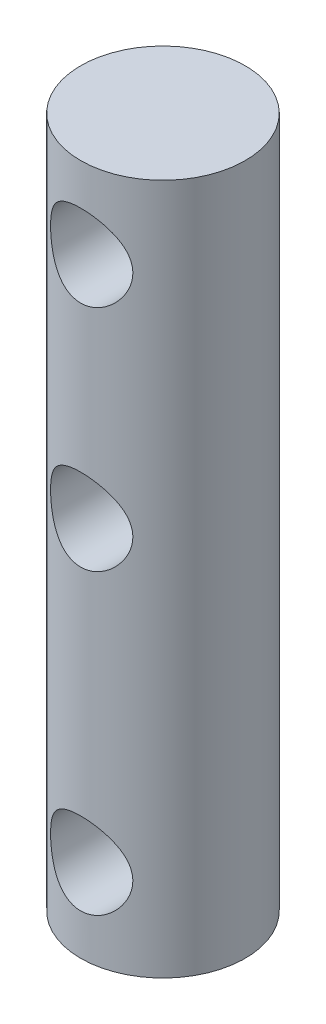
ISO-10303-21;
HEADER;
FILE_DESCRIPTION(('STEP AP214'),'2;1');
FILE_NAME('part.step','',(''),(''),'','','');
FILE_SCHEMA(('AUTOMOTIVE_DESIGN { 1 0 10303 214 1 1 1 1 }'));
ENDSEC;
DATA;
#1=APPLICATION_CONTEXT('core data for automotive mechanical design processes');
#2=APPLICATION_PROTOCOL_DEFINITION('international standard','automotive_design',2000,#1);
#3=PRODUCT_CONTEXT('',#1,'mechanical');
#4=PRODUCT('Part','Part','',(#3));
#5=PRODUCT_RELATED_PRODUCT_CATEGORY('part','',(#4));
#6=PRODUCT_DEFINITION_FORMATION('','',#4);
#7=PRODUCT_DEFINITION_CONTEXT('part definition',#1,'design');
#8=PRODUCT_DEFINITION('design','',#6,#7);
#9=PRODUCT_DEFINITION_SHAPE('','',#8);
#10=(LENGTH_UNIT() NAMED_UNIT(*) SI_UNIT(.MILLI.,.METRE.));
#11=(NAMED_UNIT(*) PLANE_ANGLE_UNIT() SI_UNIT($,.RADIAN.));
#12=(NAMED_UNIT(*) SI_UNIT($,.STERADIAN.) SOLID_ANGLE_UNIT());
#13=UNCERTAINTY_MEASURE_WITH_UNIT(LENGTH_MEASURE(1.E-05),#10,'distance_accuracy_value','');
#14=(GEOMETRIC_REPRESENTATION_CONTEXT(3) GLOBAL_UNCERTAINTY_ASSIGNED_CONTEXT((#13)) GLOBAL_UNIT_ASSIGNED_CONTEXT((#10,
#11,#12)) REPRESENTATION_CONTEXT('',''));
#15=CARTESIAN_POINT('',(0.,0.,0.));
#16=DIRECTION('',(0.,0.,1.));
#17=DIRECTION('',(1.,0.,0.));
#18=AXIS2_PLACEMENT_3D('',#15,#16,#17);
#19=CARTESIAN_POINT('',(0.,21.,0.));
#20=DIRECTION('',(0.,-1.,0.));
#21=DIRECTION('',(0.,0.,-1.));
#22=AXIS2_PLACEMENT_3D('',#19,#20,#21);
#23=CYLINDRICAL_SURFACE('',#22,2.5);
#24=CARTESIAN_POINT('',(0.,19.75,-2.5));
#25=CARTESIAN_POINT('',(-0.0657149536912332,19.7499958721006,-2.49999641755189));
#26=CARTESIAN_POINT('',(-0.131508249622541,19.7447874085979,-2.49738113774397));
#27=CARTESIAN_POINT('',(-0.261150294085531,19.7241838995739,-2.48717695046745));
#28=CARTESIAN_POINT('',(-0.32499510839188,19.7087695087529,-2.47957859786229));
#29=CARTESIAN_POINT('',(-0.448666931100719,19.668507739229,-2.46020349254139));
#30=CARTESIAN_POINT('',(-0.508508503673976,19.64369701969,-2.448442989719));
#31=CARTESIAN_POINT('',(-0.623090771008207,19.5855367232938,-2.42182220644723));
#32=CARTESIAN_POINT('',(-0.677831867487563,19.5521878196889,-2.40696217041912));
#33=CARTESIAN_POINT('',(-0.7843847722024,19.4756034381434,-2.37445322822571));
#34=CARTESIAN_POINT('',(-0.835819013902642,19.4318919009505,-2.3566899890942));
#35=CARTESIAN_POINT('',(-0.930974306083724,19.3368481509412,-2.3207496280843));
#36=CARTESIAN_POINT('',(-0.974689478883459,19.2855101852845,-2.30257220261294));
#37=CARTESIAN_POINT('',(-1.05656500056285,19.1718958130958,-2.26623688996684));
#38=CARTESIAN_POINT('',(-1.09403166943955,19.1090798770676,-2.24818983712665));
#39=CARTESIAN_POINT('',(-1.15771028361337,18.9770408300172,-2.21607473465401));
#40=CARTESIAN_POINT('',(-1.18393026870792,18.9078223390966,-2.20200384508737));
#41=CARTESIAN_POINT('',(-1.22266555273574,18.7691686182226,-2.18072333797261));
#42=CARTESIAN_POINT('',(-1.23590732135055,18.6999944349158,-2.17315339479642));
#43=CARTESIAN_POINT('',(-1.25053374163606,18.5600264527757,-2.1647736243566));
#44=CARTESIAN_POINT('',(-1.25193011046634,18.4892343239111,-2.1639571167911));
#45=CARTESIAN_POINT('',(-1.24335910896537,18.3571424696058,-2.1688866282156));
#46=CARTESIAN_POINT('',(-1.23473069942103,18.2957199609712,-2.17385954577517));
#47=CARTESIAN_POINT('',(-1.20867481132117,18.1753476132837,-2.18845285917313));
#48=CARTESIAN_POINT('',(-1.19124452987206,18.1163985683684,-2.1980747353972));
#49=CARTESIAN_POINT('',(-1.1477622254825,18.0009635842929,-2.22109345515926));
#50=CARTESIAN_POINT('',(-1.12151883389499,17.9445670015178,-2.23457300829998));
#51=CARTESIAN_POINT('',(-1.061302109585,17.8367071342625,-2.26379255351755));
#52=CARTESIAN_POINT('',(-1.02732530476558,17.7852460804999,-2.27953355975238));
#53=CARTESIAN_POINT('',(-0.947582568640986,17.681848434071,-2.31391447379107));
#54=CARTESIAN_POINT('',(-0.900868072961603,17.6306789080298,-2.33266887795933));
#55=CARTESIAN_POINT('',(-0.799444473426718,17.5365807267614,-2.36934529125509));
#56=CARTESIAN_POINT('',(-0.744731570717857,17.4936560099577,-2.38726689948501));
#57=CARTESIAN_POINT('',(-0.62564563228981,17.4153929237128,-2.42127484103705));
#58=CARTESIAN_POINT('',(-0.56094198949926,17.3804994094428,-2.43723730202509));
#59=CARTESIAN_POINT('',(-0.425582769360995,17.3223787136962,-2.46447351401553));
#60=CARTESIAN_POINT('',(-0.354931970331595,17.299142268731,-2.47575098679441));
#61=CARTESIAN_POINT('',(-0.215958114575878,17.2669057453542,-2.49155417176795));
#62=CARTESIAN_POINT('',(-0.147926913185406,17.2568859553165,-2.4965617287664));
#63=CARTESIAN_POINT('',(-0.0109744999366928,17.2481690860819,-2.50091266823877));
#64=CARTESIAN_POINT('',(0.057946274837376,17.2494666429507,-2.5002587340164));
#65=CARTESIAN_POINT('',(0.189041214982491,17.2627583605234,-2.49363990316801));
#66=CARTESIAN_POINT('',(0.251324260062443,17.2739156659125,-2.48809057110237));
#67=CARTESIAN_POINT('',(0.373008615377396,17.3052975898689,-2.47277714143524));
#68=CARTESIAN_POINT('',(0.432409607113746,17.3255232080667,-2.46301257917916));
#69=CARTESIAN_POINT('',(0.548610760562081,17.3749980830415,-2.43980314267087));
#70=CARTESIAN_POINT('',(0.605287996257691,17.404488812646,-2.42626102212424));
#71=CARTESIAN_POINT('',(0.713076702123651,17.4713844195576,-2.39679967896386));
#72=CARTESIAN_POINT('',(0.764185787219103,17.5087926682418,-2.38087944457231));
#73=CARTESIAN_POINT('',(0.864709611613317,17.5947005316661,-2.3463527667183));
#74=CARTESIAN_POINT('',(0.913465097280799,17.643928585567,-2.32763606060552));
#75=CARTESIAN_POINT('',(1.00232040139155,17.7499064390866,-2.29077989504843));
#76=CARTESIAN_POINT('',(1.04241423211355,17.8066613985205,-2.27264084226908));
#77=CARTESIAN_POINT('',(1.11463489312212,17.9295545677504,-2.23813990282585));
#78=CARTESIAN_POINT('',(1.1462818698483,17.9960140827607,-2.2219066207934));
#79=CARTESIAN_POINT('',(1.19760353251725,18.1343875846157,-2.19467590460158));
#80=CARTESIAN_POINT('',(1.21729364485946,18.2062944081265,-2.18367172800772));
#81=CARTESIAN_POINT('',(1.2423271093121,18.3461377785768,-2.16951876260833));
#82=CARTESIAN_POINT('',(1.24886624550108,18.4137928167863,-2.16571729325614));
#83=CARTESIAN_POINT('',(1.25086144297599,18.5493088339634,-2.16456693307719));
#84=CARTESIAN_POINT('',(1.2463223082805,18.6171697109243,-2.16721524534441));
#85=CARTESIAN_POINT('',(1.22740765699033,18.744354376915,-2.17797327562531));
#86=CARTESIAN_POINT('',(1.2140103929285,18.8038755876805,-2.18553868102992));
#87=CARTESIAN_POINT('',(1.17896919778081,18.9197601492809,-2.20463770234897));
#88=CARTESIAN_POINT('',(1.15732261394976,18.976122477615,-2.21617259462094));
#89=CARTESIAN_POINT('',(1.10476968162585,19.0882810637333,-2.2428566295566));
#90=CARTESIAN_POINT('',(1.07333892227057,19.1437848772871,-2.25819652995238));
#91=CARTESIAN_POINT('',(1.0026887145458,19.2490931702257,-2.29044164543238));
#92=CARTESIAN_POINT('',(0.963465214048313,19.2988946631481,-2.30734767243152));
#93=CARTESIAN_POINT('',(0.872754158330804,19.397677477947,-2.34327903949141));
#94=CARTESIAN_POINT('',(0.820355528762717,19.4458238779524,-2.36231229139336));
#95=CARTESIAN_POINT('',(0.707693507775352,19.5328287292795,-2.39847190318859));
#96=CARTESIAN_POINT('',(0.647425904070984,19.5716821742829,-2.4155972326005));
#97=CARTESIAN_POINT('',(0.519914496024935,19.6390454534528,-2.44622511981379));
#98=CARTESIAN_POINT('',(0.452624379918269,19.6674802117643,-2.45970120703636));
#99=CARTESIAN_POINT('',(0.31342762661774,19.7122602098987,-2.48126676704332));
#100=CARTESIAN_POINT('',(0.241534749528959,19.728639808537,-2.48937154216165));
#101=CARTESIAN_POINT('',(0.140752433104231,19.7423717638448,-2.49619327387079));
#102=CARTESIAN_POINT('',(0.112702349299375,19.7452283010795,-2.49761706674002));
#103=CARTESIAN_POINT('',(0.0564396647589483,19.749043331896,-2.49952121222331));
#104=CARTESIAN_POINT('',(0.0282270595592273,19.750001773089,-2.50000153879704));
#105=CARTESIAN_POINT('',(0.,19.75,-2.5));
#106=B_SPLINE_CURVE_WITH_KNOTS('',3,(#24,#25,#26,#27,#28,#29,#30,#31,#32,#33,#34,#35,#36,#37,
#38,#39,#40,#41,#42,#43,#44,#45,#46,#47,#48,#49,#50,#51,#52,#53,#54,#55,#56,#57,#58,#59,#60,#61,
#62,#63,#64,#65,#66,#67,#68,#69,#70,#71,#72,#73,#74,#75,#76,#77,#78,#79,#80,#81,#82,#83,#84,#85,
#86,#87,#88,#89,#90,#91,#92,#93,#94,#95,#96,#97,#98,#99,#100,#101,#102,#103,#104,#105),
.UNSPECIFIED.,.T.,.F.,(4,2,2,2,2,2,2,2,2,2,2,2,2,2,2,2,2,2,2,2,2,2,2,2,2,2,2,2,2,2,2,2,2,2,2,2,
2,2,2,2,4),(0.,0.197030321775366,0.394435187136497,0.591077694365374,0.78770470072696,
0.996227198397616,1.20490779706754,1.42977158038441,1.65447434872851,1.86572515175287,
2.07676696661276,2.26257140511651,2.44843504907099,2.63862800210609,2.82890651575278,
3.04331176667348,3.25781918248358,3.48228777768051,3.7065777114035,3.91229113089182,
4.11790705639345,4.30758633132653,4.49728652038665,4.69241070034873,4.88761813435424,
5.10199513305524,5.3165198576929,5.54143352699593,5.76605639925972,5.96911634372967,
6.17208824825007,6.35572412805229,6.53941910979598,6.73545570969518,6.93159451423697,
7.15156553440623,7.37165479220716,7.59330017078657,7.81431135781163,7.89894100172122,
7.98357298143559),.UNSPECIFIED.);
#107=CARTESIAN_POINT('',(0.,19.75,-2.5));
#108=VERTEX_POINT('',#107);
#109=EDGE_CURVE('E10',#108,#108,#106,.T.);
#110=ORIENTED_EDGE('',*,*,#109,.T.);
#111=EDGE_LOOP('',(#110));
#112=FACE_BOUND('',#111,.T.);
#113=CARTESIAN_POINT('',(1.25,18.5,2.1650635094611));
#114=CARTESIAN_POINT('',(1.24999545384317,18.4348652397559,2.16506918410574));
#115=CARTESIAN_POINT('',(1.24487496341652,18.3696482355937,2.16804751484696));
#116=CARTESIAN_POINT('',(1.22465401237257,18.2412159191536,2.17952958065065));
#117=CARTESIAN_POINT('',(1.20953258069272,18.1780051061957,2.18804492569449));
#118=CARTESIAN_POINT('',(1.17012493587477,18.0556854195701,2.20936683256748));
#119=CARTESIAN_POINT('',(1.14588744061716,17.996556684408,2.22215054341565));
#120=CARTESIAN_POINT('',(1.08908440672047,17.8832197475041,2.25053331021072));
#121=CARTESIAN_POINT('',(1.05651841754472,17.8290118121719,2.26613251845081));
#122=CARTESIAN_POINT('',(0.980833175663598,17.7221178393031,2.29996086321802));
#123=CARTESIAN_POINT('',(0.937065045179712,17.6699260804081,2.31830079547442));
#124=CARTESIAN_POINT('',(0.841567259518083,17.5732395144916,2.35464978482132));
#125=CARTESIAN_POINT('',(0.789833657227863,17.5287485467706,2.37265867289062));
#126=CARTESIAN_POINT('',(0.67561195426818,17.4457910610654,2.40776846191186));
#127=CARTESIAN_POINT('',(0.612633986265717,17.4079327901756,2.42472633022716));
#128=CARTESIAN_POINT('',(0.480196283249379,17.3435739334428,2.45438445124411));
#129=CARTESIAN_POINT('',(0.410740672672693,17.3170661798285,2.46708738979677));
#130=CARTESIAN_POINT('',(0.27255617990747,17.2781191733736,2.48600576555297));
#131=CARTESIAN_POINT('',(0.204127238111021,17.2648130920556,2.49261850276115));
#132=CARTESIAN_POINT('',(0.0657132858723097,17.2497923516562,2.50009479807584));
#133=CARTESIAN_POINT('',(-0.00427075730467368,17.2480706790054,2.50096183480737));
#134=CARTESIAN_POINT('',(-0.137290655529688,17.2559333424629,2.49703727395563));
#135=CARTESIAN_POINT('',(-0.20040149897099,17.2645475194015,2.492731198652));
#136=CARTESIAN_POINT('',(-0.324142214897903,17.2911010548808,2.47967806574684));
#137=CARTESIAN_POINT('',(-0.384771901367408,17.3090411112203,2.47093067582992));
#138=CARTESIAN_POINT('',(-0.502886739461943,17.3538532076123,2.44964479109568));
#139=CARTESIAN_POINT('',(-0.560316779393974,17.3808453914651,2.43705551911499));
#140=CARTESIAN_POINT('',(-0.669971001891661,17.4428292702519,2.40922057483359));
#141=CARTESIAN_POINT('',(-0.722193311048308,17.4778238291279,2.39397395196855));
#142=CARTESIAN_POINT('',(-0.825217076122744,17.5586191894163,2.36055492999036));
#143=CARTESIAN_POINT('',(-0.875417593786702,17.6051287854075,2.34224219997719));
#144=CARTESIAN_POINT('',(-0.967630462872227,17.7057371561627,2.30567925733514));
#145=CARTESIAN_POINT('',(-1.00963651446779,17.7598417153426,2.28742910332036));
#146=CARTESIAN_POINT('',(-1.08688166830277,17.8783102405301,2.25180195115606));
#147=CARTESIAN_POINT('',(-1.12152164372257,17.9431075288178,2.23455399988384));
#148=CARTESIAN_POINT('',(-1.17914889125154,18.0786720891988,2.2046931284822));
#149=CARTESIAN_POINT('',(-1.20214832276361,18.149433041272,2.19207537557584));
#150=CARTESIAN_POINT('',(-1.2339752637813,18.2890181391035,2.17430794771293));
#151=CARTESIAN_POINT('',(-1.24378140264997,18.3575513988044,2.1686456981062));
#152=CARTESIAN_POINT('',(-1.25189618326428,18.4955016768957,2.16397399202012));
#153=CARTESIAN_POINT('',(-1.25021294664378,18.5649180363997,2.16495983611639));
#154=CARTESIAN_POINT('',(-1.23629505417996,18.6945673982234,2.17292920675731));
#155=CARTESIAN_POINT('',(-1.22523477089059,18.7549743138849,2.17924484383318));
#156=CARTESIAN_POINT('',(-1.19462035579055,18.8729597328387,2.19617526939176));
#157=CARTESIAN_POINT('',(-1.17506347327952,18.9305373134333,2.20679145006292));
#158=CARTESIAN_POINT('',(-1.12705948575611,19.0442641636284,2.23170277599571));
#159=CARTESIAN_POINT('',(-1.09824257961591,19.1002237710669,2.24614554053829));
#160=CARTESIAN_POINT('',(-1.03285883001976,19.2068365894237,2.27695149371562));
#161=CARTESIAN_POINT('',(-0.996288005415271,19.2574870543916,2.29331566693934));
#162=CARTESIAN_POINT('',(-0.911046458998567,19.3587234594044,2.3285999807042));
#163=CARTESIAN_POINT('',(-0.861431590393709,19.4084964383971,2.34758228942861));
#164=CARTESIAN_POINT('',(-0.754255619247861,19.499265297492,2.38417793722366));
#165=CARTESIAN_POINT('',(-0.696691843319184,19.5402582127882,2.40179081259637));
#166=CARTESIAN_POINT('',(-0.573169203198447,19.6132171574376,2.43426702113696));
#167=CARTESIAN_POINT('',(-0.507028871967642,19.6449163977636,2.44904552090037));
#168=CARTESIAN_POINT('',(-0.369402955801353,19.6964223798217,2.47354193699126));
#169=CARTESIAN_POINT('',(-0.29792212674022,19.7162395642079,2.48326429595466));
#170=CARTESIAN_POINT('',(-0.158724602913022,19.7417107052183,2.49584385227353));
#171=CARTESIAN_POINT('',(-0.0912643048130714,19.7484973448451,2.49924909885239));
#172=CARTESIAN_POINT('',(0.0439074824390048,19.751054081818,2.50052662968914));
#173=CARTESIAN_POINT('',(0.111618875368859,19.7468280356545,2.49840085083612));
#174=CARTESIAN_POINT('',(0.240672490396435,19.7282294915055,2.48917461047403));
#175=CARTESIAN_POINT('',(0.302140397264081,19.7145439384279,2.48241118334987));
#176=CARTESIAN_POINT('',(0.421807440229523,19.6783412508713,2.46490117079279));
#177=CARTESIAN_POINT('',(0.480006106194387,19.6558228498832,2.45415401415995));
#178=CARTESIAN_POINT('',(0.594279257806106,19.6015911847925,2.4290741343515));
#179=CARTESIAN_POINT('',(0.650156428375059,19.5695258459902,2.41460771498499));
#180=CARTESIAN_POINT('',(0.755968302267532,19.4975525864262,2.38360166427283));
#181=CARTESIAN_POINT('',(0.805900259268635,19.4576410636054,2.36706108197951));
#182=CARTESIAN_POINT('',(0.903642505196115,19.3665035762216,2.33160762783284));
#183=CARTESIAN_POINT('',(0.95074710567409,19.3145468906535,2.31262248764622));
#184=CARTESIAN_POINT('',(1.03582910924334,19.2031865985878,2.27578845203565));
#185=CARTESIAN_POINT('',(1.07379843751257,19.1437764739154,2.25794057202332));
#186=CARTESIAN_POINT('',(1.14053884973207,19.0167041917738,2.22499506631145));
#187=CARTESIAN_POINT('',(1.16898133245117,18.9488405860891,2.21000217820338));
#188=CARTESIAN_POINT('',(1.21359838688302,18.8083344945753,2.18582695410439));
#189=CARTESIAN_POINT('',(1.22981398896918,18.7357088888591,2.17662520184627));
#190=CARTESIAN_POINT('',(1.24295875983052,18.635243305435,2.16911590752238));
#191=CARTESIAN_POINT('',(1.24559513120482,18.6082901320026,2.1676016125644));
#192=CARTESIAN_POINT('',(1.24911675636245,18.5542293991472,2.16557419859688));
#193=CARTESIAN_POINT('',(1.25000189299984,18.5271218295177,2.16506114656387));
#194=CARTESIAN_POINT('',(1.25,18.5,2.1650635094611));
#195=B_SPLINE_CURVE_WITH_KNOTS('',3,(#113,#114,#115,#116,#117,#118,#119,#120,#121,#122,#123,
#124,#125,#126,#127,#128,#129,#130,#131,#132,#133,#134,#135,#136,#137,#138,#139,#140,#141,#142,
#143,#144,#145,#146,#147,#148,#149,#150,#151,#152,#153,#154,#155,#156,#157,#158,#159,#160,#161,
#162,#163,#164,#165,#166,#167,#168,#169,#170,#171,#172,#173,#174,#175,#176,#177,#178,#179,#180,
#181,#182,#183,#184,#185,#186,#187,#188,#189,#190,#191,#192,#193,#194),.UNSPECIFIED.,.T.,.F.,(4,
2,2,2,2,2,2,2,2,2,2,2,2,2,2,2,2,2,2,2,2,2,2,2,2,2,2,2,2,2,2,2,2,2,2,2,2,2,2,2,4),(0.,
0.195290153243394,0.390991116031008,0.585660744898608,0.780340906806438,0.991077890622798,
1.20191963855464,1.42697365298455,1.65188533704864,1.86079356209919,2.0695752960755,
2.26020121855673,2.45084140646819,2.64411918413934,2.8374662418784,3.04908989321114,
3.26087560307399,3.48611052161811,3.71110967764632,3.91827863567765,4.12530116485467,
4.30967729280032,4.49411315545079,4.6870912050761,4.8801685777506,5.09758429475767,
5.31507331222753,5.53830226766208,5.76133474760965,5.96390337986859,6.16640108492465,
6.35555531089366,6.54473666890017,6.74200938399341,6.93937287625899,7.15637802312585,
7.37357428556443,7.59763436298257,7.82093916253451,7.90225168981638,7.98356965618176),.UNSPECIFIED.);
#196=CARTESIAN_POINT('',(1.25,18.5,2.1650635094611));
#197=VERTEX_POINT('',#196);
#198=EDGE_CURVE('E51',#197,#197,#195,.T.);
#199=ORIENTED_EDGE('',*,*,#198,.T.);
#200=EDGE_LOOP('',(#199));
#201=FACE_BOUND('',#200,.T.);
#202=CARTESIAN_POINT('',(0.,3.75,-2.5));
#203=CARTESIAN_POINT('',(-0.0657149536912329,3.74999587210063,-2.49999641755189));
#204=CARTESIAN_POINT('',(-0.13150824962254,3.74478740859791,-2.49738113774397));
#205=CARTESIAN_POINT('',(-0.261150294085531,3.72418389957385,-2.48717695046745));
#206=CARTESIAN_POINT('',(-0.324995108391879,3.70876950875294,-2.47957859786229));
#207=CARTESIAN_POINT('',(-0.448666931100718,3.66850773922901,-2.46020349254139));
#208=CARTESIAN_POINT('',(-0.508508503673975,3.64369701968998,-2.448442989719));
#209=CARTESIAN_POINT('',(-0.623090771008207,3.58553672329382,-2.42182220644723));
#210=CARTESIAN_POINT('',(-0.677831867487563,3.55218781968893,-2.40696217041912));
#211=CARTESIAN_POINT('',(-0.784384772202399,3.47560343814338,-2.37445322822571));
#212=CARTESIAN_POINT('',(-0.83581901390264,3.43189190095045,-2.3566899890942));
#213=CARTESIAN_POINT('',(-0.930974306083722,3.33684815094121,-2.3207496280843));
#214=CARTESIAN_POINT('',(-0.974689478883458,3.28551018528445,-2.30257220261294));
#215=CARTESIAN_POINT('',(-1.05656500056285,3.17189581309577,-2.26623688996684));
#216=CARTESIAN_POINT('',(-1.09403166943955,3.10907987706761,-2.24818983712665));
#217=CARTESIAN_POINT('',(-1.15771028361337,2.97704083001723,-2.21607473465401));
#218=CARTESIAN_POINT('',(-1.18393026870792,2.90782233909656,-2.20200384508737));
#219=CARTESIAN_POINT('',(-1.22266555273574,2.7691686182226,-2.18072333797261));
#220=CARTESIAN_POINT('',(-1.23590732135055,2.69999443491576,-2.17315339479642));
#221=CARTESIAN_POINT('',(-1.25053374163606,2.56002645277565,-2.1647736243566));
#222=CARTESIAN_POINT('',(-1.25193011046634,2.48923432391105,-2.1639571167911));
#223=CARTESIAN_POINT('',(-1.24335910896537,2.35714246960579,-2.16888662821561));
#224=CARTESIAN_POINT('',(-1.23473069942103,2.29571996097118,-2.17385954577517));
#225=CARTESIAN_POINT('',(-1.20867481132117,2.1753476132837,-2.18845285917313));
#226=CARTESIAN_POINT('',(-1.19124452987206,2.11639856836835,-2.1980747353972));
#227=CARTESIAN_POINT('',(-1.1477622254825,2.00096358429292,-2.22109345515926));
#228=CARTESIAN_POINT('',(-1.12151883389499,1.94456700151776,-2.23457300829998));
#229=CARTESIAN_POINT('',(-1.061302109585,1.83670713426249,-2.26379255351755));
#230=CARTESIAN_POINT('',(-1.02732530476558,1.78524608049989,-2.27953355975238));
#231=CARTESIAN_POINT('',(-0.947582568640986,1.68184843407097,-2.31391447379107));
#232=CARTESIAN_POINT('',(-0.900868072961602,1.6306789080298,-2.33266887795933));
#233=CARTESIAN_POINT('',(-0.799444473426717,1.53658072676137,-2.36934529125509));
#234=CARTESIAN_POINT('',(-0.744731570717857,1.49365600995765,-2.38726689948501));
#235=CARTESIAN_POINT('',(-0.625645632289811,1.41539292371284,-2.42127484103705));
#236=CARTESIAN_POINT('',(-0.560941989499261,1.38049940944282,-2.43723730202509));
#237=CARTESIAN_POINT('',(-0.425582769360997,1.32237871369624,-2.46447351401553));
#238=CARTESIAN_POINT('',(-0.354931970331596,1.29914226873104,-2.47575098679441));
#239=CARTESIAN_POINT('',(-0.215958114575878,1.26690574535415,-2.49155417176795));
#240=CARTESIAN_POINT('',(-0.147926913185406,1.25688595531653,-2.4965617287664));
#241=CARTESIAN_POINT('',(-0.0109744999366926,1.24816908608189,-2.50091266823877));
#242=CARTESIAN_POINT('',(0.0579462748373762,1.24946664295065,-2.5002587340164));
#243=CARTESIAN_POINT('',(0.189041214982492,1.26275836052344,-2.49363990316801));
#244=CARTESIAN_POINT('',(0.251324260062443,1.27391566591254,-2.48809057110237));
#245=CARTESIAN_POINT('',(0.373008615377396,1.30529758986885,-2.47277714143524));
#246=CARTESIAN_POINT('',(0.432409607113746,1.3255232080667,-2.46301257917916));
#247=CARTESIAN_POINT('',(0.548610760562082,1.37499808304146,-2.43980314267087));
#248=CARTESIAN_POINT('',(0.605287996257692,1.40448881264601,-2.42626102212424));
#249=CARTESIAN_POINT('',(0.713076702123652,1.47138441955755,-2.39679967896386));
#250=CARTESIAN_POINT('',(0.764185787219103,1.50879266824179,-2.38087944457231));
#251=CARTESIAN_POINT('',(0.864709611613317,1.59470053166609,-2.3463527667183));
#252=CARTESIAN_POINT('',(0.913465097280799,1.64392858556695,-2.32763606060552));
#253=CARTESIAN_POINT('',(1.00232040139155,1.74990643908663,-2.29077989504843));
#254=CARTESIAN_POINT('',(1.04241423211355,1.80666139852047,-2.27264084226908));
#255=CARTESIAN_POINT('',(1.11463489312212,1.92955456775039,-2.23813990282585));
#256=CARTESIAN_POINT('',(1.1462818698483,1.99601408276074,-2.2219066207934));
#257=CARTESIAN_POINT('',(1.19760353251725,2.13438758461565,-2.19467590460158));
#258=CARTESIAN_POINT('',(1.21729364485946,2.20629440812648,-2.18367172800773));
#259=CARTESIAN_POINT('',(1.2423271093121,2.34613777857681,-2.16951876260833));
#260=CARTESIAN_POINT('',(1.24886624550108,2.41379281678629,-2.16571729325614));
#261=CARTESIAN_POINT('',(1.25086144297598,2.54930883396341,-2.16456693307719));
#262=CARTESIAN_POINT('',(1.2463223082805,2.61716971092429,-2.16721524534441));
#263=CARTESIAN_POINT('',(1.22740765699033,2.74435437691502,-2.17797327562531));
#264=CARTESIAN_POINT('',(1.2140103929285,2.8038755876805,-2.18553868102992));
#265=CARTESIAN_POINT('',(1.17896919778081,2.91976014928088,-2.20463770234897));
#266=CARTESIAN_POINT('',(1.15732261394976,2.97612247761496,-2.21617259462094));
#267=CARTESIAN_POINT('',(1.10476968162585,3.08828106373326,-2.2428566295566));
#268=CARTESIAN_POINT('',(1.07333892227057,3.14378487728712,-2.25819652995238));
#269=CARTESIAN_POINT('',(1.00268871454579,3.24909317022573,-2.29044164543238));
#270=CARTESIAN_POINT('',(0.963465214048311,3.29889466314811,-2.30734767243153));
#271=CARTESIAN_POINT('',(0.872754158330802,3.39767747794702,-2.34327903949141));
#272=CARTESIAN_POINT('',(0.820355528762715,3.4458238779524,-2.36231229139336));
#273=CARTESIAN_POINT('',(0.70769350777535,3.53282872927954,-2.3984719031886));
#274=CARTESIAN_POINT('',(0.647425904070982,3.57168217428286,-2.4155972326005));
#275=CARTESIAN_POINT('',(0.519914496024934,3.63904545345275,-2.44622511981379));
#276=CARTESIAN_POINT('',(0.452624379918268,3.66748021176429,-2.45970120703636));
#277=CARTESIAN_POINT('',(0.313427626617739,3.71226020989869,-2.48126676704332));
#278=CARTESIAN_POINT('',(0.241534749528957,3.72863980853697,-2.48937154216165));
#279=CARTESIAN_POINT('',(0.140752433104229,3.74237176384481,-2.49619327387079));
#280=CARTESIAN_POINT('',(0.112702349299373,3.74522830107952,-2.49761706674002));
#281=CARTESIAN_POINT('',(0.056439664758947,3.74904333189601,-2.49952121222331));
#282=CARTESIAN_POINT('',(0.0282270595592267,3.750001773089,-2.50000153879704));
#283=CARTESIAN_POINT('',(0.,3.75,-2.5));
#284=B_SPLINE_CURVE_WITH_KNOTS('',3,(#202,#203,#204,#205,#206,#207,#208,#209,#210,#211,#212,
#213,#214,#215,#216,#217,#218,#219,#220,#221,#222,#223,#224,#225,#226,#227,#228,#229,#230,#231,
#232,#233,#234,#235,#236,#237,#238,#239,#240,#241,#242,#243,#244,#245,#246,#247,#248,#249,#250,
#251,#252,#253,#254,#255,#256,#257,#258,#259,#260,#261,#262,#263,#264,#265,#266,#267,#268,#269,
#270,#271,#272,#273,#274,#275,#276,#277,#278,#279,#280,#281,#282,#283),.UNSPECIFIED.,.T.,.F.,(4,
2,2,2,2,2,2,2,2,2,2,2,2,2,2,2,2,2,2,2,2,2,2,2,2,2,2,2,2,2,2,2,2,2,2,2,2,2,2,2,4),(0.,
0.197030321775365,0.394435187136497,0.591077694365374,0.78770470072696,0.996227198397611,
1.20490779706754,1.42977158038441,1.65447434872851,1.86572515175287,2.07676696661276,
2.26257140511651,2.44843504907098,2.63862800210609,2.82890651575277,3.04331176667348,
3.25781918248358,3.48228777768051,3.70657771140349,3.91229113089182,4.11790705639345,
4.30758633132653,4.49728652038664,4.69241070034873,4.88761813435424,5.10199513305524,
5.3165198576929,5.54143352699593,5.76605639925972,5.96911634372967,6.17208824825007,
6.35572412805228,6.53941910979598,6.73545570969518,6.93159451423697,7.15156553440623,
7.37165479220716,7.59330017078657,7.81431135781163,7.89894100172122,7.98357298143559),.UNSPECIFIED.);
#285=CARTESIAN_POINT('',(0.,3.75,-2.5));
#286=VERTEX_POINT('',#285);
#287=EDGE_CURVE('E58',#286,#286,#284,.T.);
#288=ORIENTED_EDGE('',*,*,#287,.T.);
#289=EDGE_LOOP('',(#288));
#290=FACE_BOUND('',#289,.T.);
#291=CARTESIAN_POINT('',(1.25,2.5,2.1650635094611));
#292=CARTESIAN_POINT('',(1.24999545384316,2.43486523975594,2.16506918410574));
#293=CARTESIAN_POINT('',(1.24487496341652,2.36964823559369,2.16804751484696));
#294=CARTESIAN_POINT('',(1.22465401237257,2.24121591915356,2.17952958065065));
#295=CARTESIAN_POINT('',(1.20953258069272,2.17800510619574,2.18804492569449));
#296=CARTESIAN_POINT('',(1.17012493587477,2.05568541957007,2.20936683256748));
#297=CARTESIAN_POINT('',(1.14588744061716,1.99655668440802,2.22215054341565));
#298=CARTESIAN_POINT('',(1.08908440672047,1.8832197475041,2.25053331021072));
#299=CARTESIAN_POINT('',(1.05651841754472,1.82901181217193,2.26613251845081));
#300=CARTESIAN_POINT('',(0.9808331756636,1.72211783930312,2.29996086321802));
#301=CARTESIAN_POINT('',(0.937065045179714,1.66992608040807,2.31830079547442));
#302=CARTESIAN_POINT('',(0.841567259518087,1.57323951449161,2.35464978482132));
#303=CARTESIAN_POINT('',(0.789833657227868,1.5287485467706,2.37265867289062));
#304=CARTESIAN_POINT('',(0.675611954268185,1.44579106106542,2.40776846191186));
#305=CARTESIAN_POINT('',(0.612633986265721,1.40793279017559,2.42472633022716));
#306=CARTESIAN_POINT('',(0.480196283249382,1.3435739334428,2.45438445124411));
#307=CARTESIAN_POINT('',(0.410740672672696,1.31706617982854,2.46708738979677));
#308=CARTESIAN_POINT('',(0.272556179907474,1.27811917337363,2.48600576555297));
#309=CARTESIAN_POINT('',(0.204127238111024,1.26481309205558,2.49261850276115));
#310=CARTESIAN_POINT('',(0.0657132858723123,1.2497923516562,2.50009479807584));
#311=CARTESIAN_POINT('',(-0.00427075730467107,1.24807067900536,2.50096183480737));
#312=CARTESIAN_POINT('',(-0.137290655529686,1.25593334246293,2.49703727395563));
#313=CARTESIAN_POINT('',(-0.200401498970988,1.26454751940153,2.492731198652));
#314=CARTESIAN_POINT('',(-0.324142214897901,1.29110105488082,2.47967806574684));
#315=CARTESIAN_POINT('',(-0.384771901367405,1.30904111122028,2.47093067582992));
#316=CARTESIAN_POINT('',(-0.502886739461941,1.35385320761226,2.44964479109568));
#317=CARTESIAN_POINT('',(-0.560316779393972,1.38084539146508,2.43705551911499));
#318=CARTESIAN_POINT('',(-0.66997100189166,1.44282927025186,2.40922057483359));
#319=CARTESIAN_POINT('',(-0.722193311048306,1.47782382912794,2.39397395196855));
#320=CARTESIAN_POINT('',(-0.825217076122743,1.55861918941627,2.36055492999036));
#321=CARTESIAN_POINT('',(-0.8754175937867,1.60512878540751,2.34224219997719));
#322=CARTESIAN_POINT('',(-0.967630462872225,1.70573715616272,2.30567925733515));
#323=CARTESIAN_POINT('',(-1.00963651446779,1.75984171534258,2.28742910332036));
#324=CARTESIAN_POINT('',(-1.08688166830276,1.87831024053011,2.25180195115606));
#325=CARTESIAN_POINT('',(-1.12152164372256,1.94310752881776,2.23455399988384));
#326=CARTESIAN_POINT('',(-1.17914889125154,2.07867208919874,2.2046931284822));
#327=CARTESIAN_POINT('',(-1.20214832276361,2.14943304127195,2.19207537557584));
#328=CARTESIAN_POINT('',(-1.2339752637813,2.28901813910348,2.17430794771293));
#329=CARTESIAN_POINT('',(-1.24378140264997,2.35755139880444,2.1686456981062));
#330=CARTESIAN_POINT('',(-1.25189618326428,2.49550167689567,2.16397399202012));
#331=CARTESIAN_POINT('',(-1.25021294664378,2.56491803639973,2.16495983611639));
#332=CARTESIAN_POINT('',(-1.23629505417996,2.69456739822341,2.17292920675731));
#333=CARTESIAN_POINT('',(-1.22523477089058,2.75497431388491,2.17924484383318));
#334=CARTESIAN_POINT('',(-1.19462035579055,2.87295973283869,2.19617526939176));
#335=CARTESIAN_POINT('',(-1.17506347327952,2.93053731343326,2.20679145006292));
#336=CARTESIAN_POINT('',(-1.12705948575611,3.04426416362837,2.23170277599571));
#337=CARTESIAN_POINT('',(-1.09824257961591,3.10022377106694,2.24614554053829));
#338=CARTESIAN_POINT('',(-1.03285883001976,3.20683658942374,2.27695149371562));
#339=CARTESIAN_POINT('',(-0.996288005415272,3.2574870543916,2.29331566693934));
#340=CARTESIAN_POINT('',(-0.911046458998569,3.35872345940443,2.3285999807042));
#341=CARTESIAN_POINT('',(-0.86143159039371,3.40849643839707,2.34758228942861));
#342=CARTESIAN_POINT('',(-0.754255619247863,3.49926529749199,2.38417793722366));
#343=CARTESIAN_POINT('',(-0.696691843319185,3.54025821278817,2.40179081259636));
#344=CARTESIAN_POINT('',(-0.573169203198448,3.61321715743763,2.43426702113696));
#345=CARTESIAN_POINT('',(-0.507028871967643,3.64491639776364,2.44904552090036));
#346=CARTESIAN_POINT('',(-0.369402955801354,3.69642237982174,2.47354193699126));
#347=CARTESIAN_POINT('',(-0.297922126740222,3.71623956420788,2.48326429595466));
#348=CARTESIAN_POINT('',(-0.158724602913023,3.74171070521833,2.49584385227353));
#349=CARTESIAN_POINT('',(-0.0912643048130728,3.74849734484514,2.49924909885239));
#350=CARTESIAN_POINT('',(0.0439074824390029,3.751054081818,2.50052662968914));
#351=CARTESIAN_POINT('',(0.111618875368857,3.74682803565445,2.49840085083612));
#352=CARTESIAN_POINT('',(0.240672490396433,3.72822949150547,2.48917461047403));
#353=CARTESIAN_POINT('',(0.302140397264079,3.71454393842791,2.48241118334987));
#354=CARTESIAN_POINT('',(0.421807440229521,3.67834125087129,2.46490117079279));
#355=CARTESIAN_POINT('',(0.480006106194385,3.65582284988318,2.45415401415995));
#356=CARTESIAN_POINT('',(0.594279257806104,3.60159118479253,2.4290741343515));
#357=CARTESIAN_POINT('',(0.650156428375056,3.5695258459902,2.41460771498499));
#358=CARTESIAN_POINT('',(0.755968302267529,3.49755258642619,2.38360166427283));
#359=CARTESIAN_POINT('',(0.805900259268632,3.45764106360541,2.36706108197951));
#360=CARTESIAN_POINT('',(0.903642505196113,3.36650357622162,2.33160762783285));
#361=CARTESIAN_POINT('',(0.950747105674088,3.31454689065351,2.31262248764622));
#362=CARTESIAN_POINT('',(1.03582910924334,3.20318659858779,2.27578845203565));
#363=CARTESIAN_POINT('',(1.07379843751257,3.1437764739154,2.25794057202332));
#364=CARTESIAN_POINT('',(1.14053884973207,3.01670419177381,2.22499506631145));
#365=CARTESIAN_POINT('',(1.16898133245117,2.94884058608908,2.21000217820338));
#366=CARTESIAN_POINT('',(1.21359838688301,2.80833449457528,2.18582695410439));
#367=CARTESIAN_POINT('',(1.22981398896918,2.73570888885914,2.17662520184627));
#368=CARTESIAN_POINT('',(1.24295875983052,2.63524330543501,2.16911590752238));
#369=CARTESIAN_POINT('',(1.24559513120481,2.60829013200265,2.1676016125644));
#370=CARTESIAN_POINT('',(1.24911675636245,2.5542293991472,2.16557419859688));
#371=CARTESIAN_POINT('',(1.25000189299984,2.52712182951766,2.16506114656387));
#372=CARTESIAN_POINT('',(1.25,2.5,2.1650635094611));
#373=B_SPLINE_CURVE_WITH_KNOTS('',3,(#291,#292,#293,#294,#295,#296,#297,#298,#299,#300,#301,
#302,#303,#304,#305,#306,#307,#308,#309,#310,#311,#312,#313,#314,#315,#316,#317,#318,#319,#320,
#321,#322,#323,#324,#325,#326,#327,#328,#329,#330,#331,#332,#333,#334,#335,#336,#337,#338,#339,
#340,#341,#342,#343,#344,#345,#346,#347,#348,#349,#350,#351,#352,#353,#354,#355,#356,#357,#358,
#359,#360,#361,#362,#363,#364,#365,#366,#367,#368,#369,#370,#371,#372),.UNSPECIFIED.,.T.,.F.,(4,
2,2,2,2,2,2,2,2,2,2,2,2,2,2,2,2,2,2,2,2,2,2,2,2,2,2,2,2,2,2,2,2,2,2,2,2,2,2,2,4),(0.,
0.195290153243394,0.390991116031005,0.585660744898606,0.780340906806436,0.991077890622791,
1.20191963855464,1.42697365298454,1.65188533704864,1.86079356209919,2.0695752960755,
2.26020121855673,2.45084140646819,2.64411918413933,2.8374662418784,3.04908989321113,
3.26087560307398,3.4861105216181,3.71110967764631,3.91827863567765,4.12530116485466,
4.30967729280032,4.49411315545079,4.6870912050761,4.88016857775059,5.09758429475766,
5.31507331222753,5.53830226766207,5.76133474760965,5.96390337986859,6.16640108492465,
6.35555531089366,6.54473666890016,6.7420093839934,6.93937287625899,7.15637802312584,
7.37357428556443,7.59763436298256,7.8209391625345,7.90225168981637,7.98356965618176),.UNSPECIFIED.);
#374=CARTESIAN_POINT('',(1.25,2.5,2.1650635094611));
#375=VERTEX_POINT('',#374);
#376=EDGE_CURVE('E64',#375,#375,#373,.T.);
#377=ORIENTED_EDGE('',*,*,#376,.T.);
#378=EDGE_LOOP('',(#377));
#379=FACE_BOUND('',#378,.T.);
#380=CARTESIAN_POINT('',(0.,12.8,-2.5));
#381=CARTESIAN_POINT('',(-0.065714953691233,12.7999958721006,-2.49999641755189));
#382=CARTESIAN_POINT('',(-0.13150824962254,12.7947874085979,-2.49738113774397));
#383=CARTESIAN_POINT('',(-0.261150294085531,12.7741838995739,-2.48717695046745));
#384=CARTESIAN_POINT('',(-0.324995108391879,12.7587695087529,-2.47957859786229));
#385=CARTESIAN_POINT('',(-0.448666931100718,12.718507739229,-2.46020349254139));
#386=CARTESIAN_POINT('',(-0.508508503673975,12.69369701969,-2.448442989719));
#387=CARTESIAN_POINT('',(-0.623090771008206,12.6355367232938,-2.42182220644723));
#388=CARTESIAN_POINT('',(-0.677831867487562,12.6021878196889,-2.40696217041913));
#389=CARTESIAN_POINT('',(-0.784384772202399,12.5256034381434,-2.37445322822571));
#390=CARTESIAN_POINT('',(-0.83581901390264,12.4818919009504,-2.3566899890942));
#391=CARTESIAN_POINT('',(-0.930974306083721,12.3868481509412,-2.3207496280843));
#392=CARTESIAN_POINT('',(-0.974689478883457,12.3355101852845,-2.30257220261294));
#393=CARTESIAN_POINT('',(-1.05656500056285,12.2218958130958,-2.26623688996684));
#394=CARTESIAN_POINT('',(-1.09403166943955,12.1590798770676,-2.24818983712665));
#395=CARTESIAN_POINT('',(-1.15771028361337,12.0270408300172,-2.21607473465401));
#396=CARTESIAN_POINT('',(-1.18393026870792,11.9578223390966,-2.20200384508737));
#397=CARTESIAN_POINT('',(-1.22266555273574,11.8191686182226,-2.18072333797261));
#398=CARTESIAN_POINT('',(-1.23590732135055,11.7499944349158,-2.17315339479642));
#399=CARTESIAN_POINT('',(-1.25053374163606,11.6100264527757,-2.1647736243566));
#400=CARTESIAN_POINT('',(-1.25193011046634,11.5392343239111,-2.1639571167911));
#401=CARTESIAN_POINT('',(-1.24335910896537,11.4071424696058,-2.16888662821561));
#402=CARTESIAN_POINT('',(-1.23473069942103,11.3457199609712,-2.17385954577517));
#403=CARTESIAN_POINT('',(-1.20867481132117,11.2253476132837,-2.18845285917313));
#404=CARTESIAN_POINT('',(-1.19124452987206,11.1663985683684,-2.1980747353972));
#405=CARTESIAN_POINT('',(-1.1477622254825,11.0509635842929,-2.22109345515926));
#406=CARTESIAN_POINT('',(-1.12151883389499,10.9945670015178,-2.23457300829998));
#407=CARTESIAN_POINT('',(-1.061302109585,10.8867071342625,-2.26379255351755));
#408=CARTESIAN_POINT('',(-1.02732530476558,10.8352460804999,-2.27953355975238));
#409=CARTESIAN_POINT('',(-0.947582568640986,10.731848434071,-2.31391447379107));
#410=CARTESIAN_POINT('',(-0.900868072961602,10.6806789080298,-2.33266887795933));
#411=CARTESIAN_POINT('',(-0.799444473426716,10.5865807267614,-2.36934529125509));
#412=CARTESIAN_POINT('',(-0.744731570717856,10.5436560099576,-2.38726689948501));
#413=CARTESIAN_POINT('',(-0.62564563228981,10.4653929237128,-2.42127484103705));
#414=CARTESIAN_POINT('',(-0.56094198949926,10.4304994094428,-2.43723730202509));
#415=CARTESIAN_POINT('',(-0.425582769360996,10.3723787136962,-2.46447351401553));
#416=CARTESIAN_POINT('',(-0.354931970331596,10.349142268731,-2.47575098679441));
#417=CARTESIAN_POINT('',(-0.215958114575878,10.3169057453542,-2.49155417176795));
#418=CARTESIAN_POINT('',(-0.147926913185406,10.3068859553165,-2.4965617287664));
#419=CARTESIAN_POINT('',(-0.0109744999366924,10.2981690860819,-2.50091266823877));
#420=CARTESIAN_POINT('',(0.0579462748373762,10.2994666429507,-2.5002587340164));
#421=CARTESIAN_POINT('',(0.189041214982491,10.3127583605234,-2.49363990316801));
#422=CARTESIAN_POINT('',(0.251324260062442,10.3239156659125,-2.48809057110237));
#423=CARTESIAN_POINT('',(0.373008615377396,10.3552975898689,-2.47277714143524));
#424=CARTESIAN_POINT('',(0.432409607113746,10.3755232080667,-2.46301257917916));
#425=CARTESIAN_POINT('',(0.548610760562081,10.4249980830415,-2.43980314267087));
#426=CARTESIAN_POINT('',(0.605287996257692,10.454488812646,-2.42626102212424));
#427=CARTESIAN_POINT('',(0.713076702123651,10.5213844195576,-2.39679967896386));
#428=CARTESIAN_POINT('',(0.764185787219102,10.5587926682418,-2.38087944457231));
#429=CARTESIAN_POINT('',(0.864709611613316,10.6447005316661,-2.3463527667183));
#430=CARTESIAN_POINT('',(0.913465097280798,10.693928585567,-2.32763606060552));
#431=CARTESIAN_POINT('',(1.00232040139155,10.7999064390866,-2.29077989504843));
#432=CARTESIAN_POINT('',(1.04241423211355,10.8566613985205,-2.27264084226908));
#433=CARTESIAN_POINT('',(1.11463489312212,10.9795545677504,-2.23813990282585));
#434=CARTESIAN_POINT('',(1.1462818698483,11.0460140827607,-2.2219066207934));
#435=CARTESIAN_POINT('',(1.19760353251725,11.1843875846157,-2.19467590460158));
#436=CARTESIAN_POINT('',(1.21729364485946,11.2562944081265,-2.18367172800773));
#437=CARTESIAN_POINT('',(1.2423271093121,11.3961377785768,-2.16951876260834));
#438=CARTESIAN_POINT('',(1.24886624550108,11.4637928167863,-2.16571729325614));
#439=CARTESIAN_POINT('',(1.25086144297598,11.5993088339634,-2.16456693307719));
#440=CARTESIAN_POINT('',(1.2463223082805,11.6671697109243,-2.16721524534441));
#441=CARTESIAN_POINT('',(1.22740765699033,11.794354376915,-2.17797327562531));
#442=CARTESIAN_POINT('',(1.2140103929285,11.8538755876805,-2.18553868102992));
#443=CARTESIAN_POINT('',(1.17896919778081,11.9697601492809,-2.20463770234897));
#444=CARTESIAN_POINT('',(1.15732261394976,12.026122477615,-2.21617259462094));
#445=CARTESIAN_POINT('',(1.10476968162585,12.1382810637333,-2.2428566295566));
#446=CARTESIAN_POINT('',(1.07333892227057,12.1937848772871,-2.25819652995238));
#447=CARTESIAN_POINT('',(1.00268871454579,12.2990931702257,-2.29044164543238));
#448=CARTESIAN_POINT('',(0.963465214048311,12.3488946631481,-2.30734767243153));
#449=CARTESIAN_POINT('',(0.872754158330803,12.447677477947,-2.34327903949141));
#450=CARTESIAN_POINT('',(0.820355528762716,12.4958238779524,-2.36231229139336));
#451=CARTESIAN_POINT('',(0.707693507775351,12.5828287292795,-2.3984719031886));
#452=CARTESIAN_POINT('',(0.647425904070983,12.6216821742829,-2.4155972326005));
#453=CARTESIAN_POINT('',(0.519914496024934,12.6890454534528,-2.44622511981379));
#454=CARTESIAN_POINT('',(0.452624379918268,12.7174802117643,-2.45970120703636));
#455=CARTESIAN_POINT('',(0.313427626617739,12.7622602098987,-2.48126676704332));
#456=CARTESIAN_POINT('',(0.241534749528958,12.778639808537,-2.48937154216165));
#457=CARTESIAN_POINT('',(0.14075243310423,12.7923717638448,-2.49619327387079));
#458=CARTESIAN_POINT('',(0.112702349299373,12.7952283010795,-2.49761706674002));
#459=CARTESIAN_POINT('',(0.056439664758947,12.799043331896,-2.49952121222331));
#460=CARTESIAN_POINT('',(0.0282270595592267,12.800001773089,-2.50000153879704));
#461=CARTESIAN_POINT('',(0.,12.8,-2.5));
#462=B_SPLINE_CURVE_WITH_KNOTS('',3,(#380,#381,#382,#383,#384,#385,#386,#387,#388,#389,#390,
#391,#392,#393,#394,#395,#396,#397,#398,#399,#400,#401,#402,#403,#404,#405,#406,#407,#408,#409,
#410,#411,#412,#413,#414,#415,#416,#417,#418,#419,#420,#421,#422,#423,#424,#425,#426,#427,#428,
#429,#430,#431,#432,#433,#434,#435,#436,#437,#438,#439,#440,#441,#442,#443,#444,#445,#446,#447,
#448,#449,#450,#451,#452,#453,#454,#455,#456,#457,#458,#459,#460,#461),.UNSPECIFIED.,.T.,.F.,(4,
2,2,2,2,2,2,2,2,2,2,2,2,2,2,2,2,2,2,2,2,2,2,2,2,2,2,2,2,2,2,2,2,2,2,2,2,2,2,2,4),(0.,
0.197030321775366,0.394435187136497,0.591077694365373,0.787704700726959,0.99622719839761,
1.20490779706754,1.42977158038441,1.65447434872851,1.86572515175287,2.07676696661275,
2.26257140511651,2.44843504907098,2.63862800210609,2.82890651575277,3.04331176667348,
3.25781918248358,3.48228777768051,3.70657771140349,3.91229113089182,4.11790705639345,
4.30758633132652,4.49728652038664,4.69241070034873,4.88761813435424,5.10199513305523,
5.3165198576929,5.54143352699592,5.76605639925972,5.96911634372967,6.17208824825006,
6.35572412805228,6.53941910979597,6.73545570969517,6.93159451423697,7.15156553440623,
7.37165479220716,7.59330017078656,7.81431135781162,7.89894100172122,7.98357298143558),.UNSPECIFIED.);
#463=CARTESIAN_POINT('',(0.,12.8,-2.5));
#464=VERTEX_POINT('',#463);
#465=EDGE_CURVE('E94',#464,#464,#462,.T.);
#466=ORIENTED_EDGE('',*,*,#465,.T.);
#467=EDGE_LOOP('',(#466));
#468=FACE_BOUND('',#467,.T.);
#469=CARTESIAN_POINT('',(1.25,11.55,2.1650635094611));
#470=CARTESIAN_POINT('',(1.24999545384316,11.4848652397559,2.16506918410574));
#471=CARTESIAN_POINT('',(1.24487496341652,11.4196482355937,2.16804751484696));
#472=CARTESIAN_POINT('',(1.22465401237257,11.2912159191536,2.17952958065066));
#473=CARTESIAN_POINT('',(1.20953258069272,11.2280051061957,2.18804492569449));
#474=CARTESIAN_POINT('',(1.17012493587476,11.1056854195701,2.20936683256748));
#475=CARTESIAN_POINT('',(1.14588744061716,11.046556684408,2.22215054341565));
#476=CARTESIAN_POINT('',(1.08908440672046,10.9332197475041,2.25053331021072));
#477=CARTESIAN_POINT('',(1.05651841754472,10.8790118121719,2.26613251845081));
#478=CARTESIAN_POINT('',(0.980833175663598,10.7721178393031,2.29996086321802));
#479=CARTESIAN_POINT('',(0.937065045179713,10.7199260804081,2.31830079547442));
#480=CARTESIAN_POINT('',(0.841567259518085,10.6232395144916,2.35464978482132));
#481=CARTESIAN_POINT('',(0.789833657227866,10.5787485467706,2.37265867289062));
#482=CARTESIAN_POINT('',(0.675611954268183,10.4957910610654,2.40776846191186));
#483=CARTESIAN_POINT('',(0.612633986265719,10.4579327901756,2.42472633022716));
#484=CARTESIAN_POINT('',(0.48019628324938,10.3935739334428,2.45438445124411));
#485=CARTESIAN_POINT('',(0.410740672672694,10.3670661798285,2.46708738979677));
#486=CARTESIAN_POINT('',(0.272556179907471,10.3281191733736,2.48600576555297));
#487=CARTESIAN_POINT('',(0.204127238111022,10.3148130920556,2.49261850276115));
#488=CARTESIAN_POINT('',(0.0657132858723107,10.2997923516562,2.50009479807584));
#489=CARTESIAN_POINT('',(-0.00427075730467237,10.2980706790054,2.50096183480737));
#490=CARTESIAN_POINT('',(-0.137290655529686,10.3059333424629,2.49703727395563));
#491=CARTESIAN_POINT('',(-0.200401498970988,10.3145475194015,2.492731198652));
#492=CARTESIAN_POINT('',(-0.324142214897902,10.3411010548808,2.47967806574684));
#493=CARTESIAN_POINT('',(-0.384771901367406,10.3590411112203,2.47093067582992));
#494=CARTESIAN_POINT('',(-0.502886739461941,10.4038532076123,2.44964479109568));
#495=CARTESIAN_POINT('',(-0.560316779393972,10.4308453914651,2.43705551911499));
#496=CARTESIAN_POINT('',(-0.669971001891659,10.4928292702519,2.40922057483359));
#497=CARTESIAN_POINT('',(-0.722193311048306,10.5278238291279,2.39397395196855));
#498=CARTESIAN_POINT('',(-0.825217076122743,10.6086191894163,2.36055492999036));
#499=CARTESIAN_POINT('',(-0.8754175937867,10.6551287854075,2.34224219997719));
#500=CARTESIAN_POINT('',(-0.967630462872225,10.7557371561627,2.30567925733515));
#501=CARTESIAN_POINT('',(-1.00963651446779,10.8098417153426,2.28742910332036));
#502=CARTESIAN_POINT('',(-1.08688166830276,10.9283102405301,2.25180195115606));
#503=CARTESIAN_POINT('',(-1.12152164372256,10.9931075288178,2.23455399988384));
#504=CARTESIAN_POINT('',(-1.17914889125154,11.1286720891987,2.2046931284822));
#505=CARTESIAN_POINT('',(-1.20214832276361,11.199433041272,2.19207537557584));
#506=CARTESIAN_POINT('',(-1.2339752637813,11.3390181391035,2.17430794771293));
#507=CARTESIAN_POINT('',(-1.24378140264997,11.4075513988044,2.1686456981062));
#508=CARTESIAN_POINT('',(-1.25189618326428,11.5455016768957,2.16397399202012));
#509=CARTESIAN_POINT('',(-1.25021294664378,11.6149180363997,2.16495983611639));
#510=CARTESIAN_POINT('',(-1.23629505417996,11.7445673982234,2.17292920675731));
#511=CARTESIAN_POINT('',(-1.22523477089058,11.8049743138849,2.17924484383318));
#512=CARTESIAN_POINT('',(-1.19462035579055,11.9229597328387,2.19617526939176));
#513=CARTESIAN_POINT('',(-1.17506347327952,11.9805373134333,2.20679145006292));
#514=CARTESIAN_POINT('',(-1.12705948575611,12.0942641636284,2.23170277599571));
#515=CARTESIAN_POINT('',(-1.0982425796159,12.1502237710669,2.24614554053829));
#516=CARTESIAN_POINT('',(-1.03285883001976,12.2568365894237,2.27695149371562));
#517=CARTESIAN_POINT('',(-0.99628800541527,12.3074870543916,2.29331566693934));
#518=CARTESIAN_POINT('',(-0.911046458998567,12.4087234594044,2.3285999807042));
#519=CARTESIAN_POINT('',(-0.861431590393709,12.4584964383971,2.34758228942861));
#520=CARTESIAN_POINT('',(-0.754255619247861,12.549265297492,2.38417793722366));
#521=CARTESIAN_POINT('',(-0.696691843319184,12.5902582127882,2.40179081259637));
#522=CARTESIAN_POINT('',(-0.573169203198447,12.6632171574376,2.43426702113696));
#523=CARTESIAN_POINT('',(-0.507028871967642,12.6949163977636,2.44904552090036));
#524=CARTESIAN_POINT('',(-0.369402955801353,12.7464223798217,2.47354193699126));
#525=CARTESIAN_POINT('',(-0.29792212674022,12.7662395642079,2.48326429595466));
#526=CARTESIAN_POINT('',(-0.158724602913022,12.7917107052183,2.49584385227353));
#527=CARTESIAN_POINT('',(-0.0912643048130718,12.7984973448451,2.49924909885239));
#528=CARTESIAN_POINT('',(0.0439074824390038,12.801054081818,2.50052662968914));
#529=CARTESIAN_POINT('',(0.111618875368858,12.7968280356545,2.49840085083612));
#530=CARTESIAN_POINT('',(0.240672490396433,12.7782294915055,2.48917461047403));
#531=CARTESIAN_POINT('',(0.302140397264079,12.7645439384279,2.48241118334987));
#532=CARTESIAN_POINT('',(0.421807440229521,12.7283412508713,2.46490117079279));
#533=CARTESIAN_POINT('',(0.480006106194385,12.7058228498832,2.45415401415995));
#534=CARTESIAN_POINT('',(0.594279257806105,12.6515911847925,2.4290741343515));
#535=CARTESIAN_POINT('',(0.650156428375056,12.6195258459902,2.41460771498499));
#536=CARTESIAN_POINT('',(0.75596830226753,12.5475525864262,2.38360166427283));
#537=CARTESIAN_POINT('',(0.805900259268633,12.5076410636054,2.36706108197951));
#538=CARTESIAN_POINT('',(0.903642505196114,12.4165035762216,2.33160762783285));
#539=CARTESIAN_POINT('',(0.950747105674089,12.3645468906535,2.31262248764622));
#540=CARTESIAN_POINT('',(1.03582910924334,12.2531865985878,2.27578845203565));
#541=CARTESIAN_POINT('',(1.07379843751257,12.1937764739154,2.25794057202332));
#542=CARTESIAN_POINT('',(1.14053884973207,12.0667041917738,2.22499506631145));
#543=CARTESIAN_POINT('',(1.16898133245117,11.9988405860891,2.21000217820338));
#544=CARTESIAN_POINT('',(1.21359838688301,11.8583344945753,2.18582695410439));
#545=CARTESIAN_POINT('',(1.22981398896918,11.7857088888591,2.17662520184627));
#546=CARTESIAN_POINT('',(1.24295875983052,11.685243305435,2.16911590752238));
#547=CARTESIAN_POINT('',(1.24559513120481,11.6582901320026,2.1676016125644));
#548=CARTESIAN_POINT('',(1.24911675636245,11.6042293991472,2.16557419859688));
#549=CARTESIAN_POINT('',(1.25000189299984,11.5771218295177,2.16506114656387));
#550=CARTESIAN_POINT('',(1.25,11.55,2.1650635094611));
#551=B_SPLINE_CURVE_WITH_KNOTS('',3,(#469,#470,#471,#472,#473,#474,#475,#476,#477,#478,#479,
#480,#481,#482,#483,#484,#485,#486,#487,#488,#489,#490,#491,#492,#493,#494,#495,#496,#497,#498,
#499,#500,#501,#502,#503,#504,#505,#506,#507,#508,#509,#510,#511,#512,#513,#514,#515,#516,#517,
#518,#519,#520,#521,#522,#523,#524,#525,#526,#527,#528,#529,#530,#531,#532,#533,#534,#535,#536,
#537,#538,#539,#540,#541,#542,#543,#544,#545,#546,#547,#548,#549,#550),.UNSPECIFIED.,.T.,.F.,(4,
2,2,2,2,2,2,2,2,2,2,2,2,2,2,2,2,2,2,2,2,2,2,2,2,2,2,2,2,2,2,2,2,2,2,2,2,2,2,2,4),(0.,
0.195290153243394,0.390991116031006,0.58566074489861,0.780340906806437,0.991077890622793,
1.20191963855464,1.42697365298454,1.65188533704864,1.86079356209919,2.0695752960755,
2.26020121855673,2.45084140646819,2.64411918413933,2.8374662418784,3.04908989321113,
3.26087560307398,3.4861105216181,3.71110967764631,3.91827863567764,4.12530116485466,
4.30967729280032,4.49411315545079,4.68709120507609,4.88016857775059,5.09758429475766,
5.31507331222753,5.53830226766207,5.76133474760964,5.96390337986858,6.16640108492464,
6.35555531089366,6.54473666890016,6.7420093839934,6.93937287625899,7.15637802312584,
7.37357428556443,7.59763436298256,7.8209391625345,7.90225168981636,7.98356965618176),.UNSPECIFIED.);
#552=CARTESIAN_POINT('',(1.25,11.55,2.1650635094611));
#553=VERTEX_POINT('',#552);
#554=EDGE_CURVE('E101',#553,#553,#551,.T.);
#555=ORIENTED_EDGE('',*,*,#554,.T.);
#556=EDGE_LOOP('',(#555));
#557=FACE_BOUND('',#556,.T.);
#558=CARTESIAN_POINT('',(0.,21.,0.));
#559=DIRECTION('',(0.,1.,0.));
#560=DIRECTION('',(0.,0.,1.));
#561=AXIS2_PLACEMENT_3D('',#558,#559,#560);
#562=CIRCLE('',#561,2.5);
#563=CARTESIAN_POINT('',(0.,21.,2.5));
#564=VERTEX_POINT('',#563);
#565=EDGE_CURVE('E108',#564,#564,#562,.T.);
#566=ORIENTED_EDGE('',*,*,#565,.F.);
#567=EDGE_LOOP('',(#566));
#568=FACE_BOUND('',#567,.T.);
#569=CARTESIAN_POINT('',(0.,0.,0.));
#570=DIRECTION('',(0.,1.,0.));
#571=DIRECTION('',(0.,0.,1.));
#572=AXIS2_PLACEMENT_3D('',#569,#570,#571);
#573=CIRCLE('',#572,2.5);
#574=CARTESIAN_POINT('',(0.,0.,2.5));
#575=VERTEX_POINT('',#574);
#576=EDGE_CURVE('E109',#575,#575,#573,.T.);
#577=ORIENTED_EDGE('',*,*,#576,.T.);
#578=EDGE_LOOP('',(#577));
#579=FACE_BOUND('',#578,.T.);
#580=ADVANCED_FACE('F39',(#112,#201,#290,#379,#468,#557,#568,#579),#23,.T.);
#581=CARTESIAN_POINT('',(0.,21.,0.));
#582=DIRECTION('',(0.,1.,0.));
#583=DIRECTION('',(0.,0.,1.));
#584=AXIS2_PLACEMENT_3D('',#581,#582,#583);
#585=PLANE('',#584);
#586=ORIENTED_EDGE('',*,*,#565,.T.);
#587=EDGE_LOOP('',(#586));
#588=FACE_BOUND('',#587,.T.);
#589=ADVANCED_FACE('F118',(#588),#585,.T.);
#590=CARTESIAN_POINT('',(0.,0.,0.));
#591=DIRECTION('',(0.,1.,0.));
#592=DIRECTION('',(0.,0.,1.));
#593=AXIS2_PLACEMENT_3D('',#590,#591,#592);
#594=PLANE('',#593);
#595=ORIENTED_EDGE('',*,*,#576,.F.);
#596=EDGE_LOOP('',(#595));
#597=FACE_BOUND('',#596,.T.);
#598=ADVANCED_FACE('F124',(#597),#594,.F.);
#599=CARTESIAN_POINT('',(0.,11.55,-2.5));
#600=DIRECTION('',(0.,0.,1.));
#601=DIRECTION('',(1.,0.,0.));
#602=AXIS2_PLACEMENT_3D('',#599,#600,#601);
#603=CYLINDRICAL_SURFACE('',#602,1.25);
#604=ORIENTED_EDGE('',*,*,#554,.F.);
#605=EDGE_LOOP('',(#604));
#606=FACE_BOUND('',#605,.T.);
#607=ORIENTED_EDGE('',*,*,#465,.F.);
#608=EDGE_LOOP('',(#607));
#609=FACE_BOUND('',#608,.T.);
#610=ADVANCED_FACE('F83',(#606,#609),#603,.F.);
#611=CARTESIAN_POINT('',(0.,2.5,-2.5));
#612=DIRECTION('',(0.,0.,1.));
#613=DIRECTION('',(1.,0.,0.));
#614=AXIS2_PLACEMENT_3D('',#611,#612,#613);
#615=CYLINDRICAL_SURFACE('',#614,1.25);
#616=ORIENTED_EDGE('',*,*,#376,.F.);
#617=EDGE_LOOP('',(#616));
#618=FACE_BOUND('',#617,.T.);
#619=ORIENTED_EDGE('',*,*,#287,.F.);
#620=EDGE_LOOP('',(#619));
#621=FACE_BOUND('',#620,.T.);
#622=ADVANCED_FACE('F77',(#618,#621),#615,.F.);
#623=CARTESIAN_POINT('',(0.,18.5,-2.5));
#624=DIRECTION('',(0.,0.,1.));
#625=DIRECTION('',(1.,0.,0.));
#626=AXIS2_PLACEMENT_3D('',#623,#624,#625);
#627=CYLINDRICAL_SURFACE('',#626,1.25);
#628=ORIENTED_EDGE('',*,*,#198,.F.);
#629=EDGE_LOOP('',(#628));
#630=FACE_BOUND('',#629,.T.);
#631=ORIENTED_EDGE('',*,*,#109,.F.);
#632=EDGE_LOOP('',(#631));
#633=FACE_BOUND('',#632,.T.);
#634=ADVANCED_FACE('F74',(#630,#633),#627,.F.);
#635=CLOSED_SHELL('',(#580,#589,#598,#610,#622,#634));
#636=MANIFOLD_SOLID_BREP('B2',#635);
#637=ADVANCED_BREP_SHAPE_REPRESENTATION('',(#18,#636),#14);
#638=SHAPE_DEFINITION_REPRESENTATION(#9,#637);
ENDSEC;
END-ISO-10303-21;
